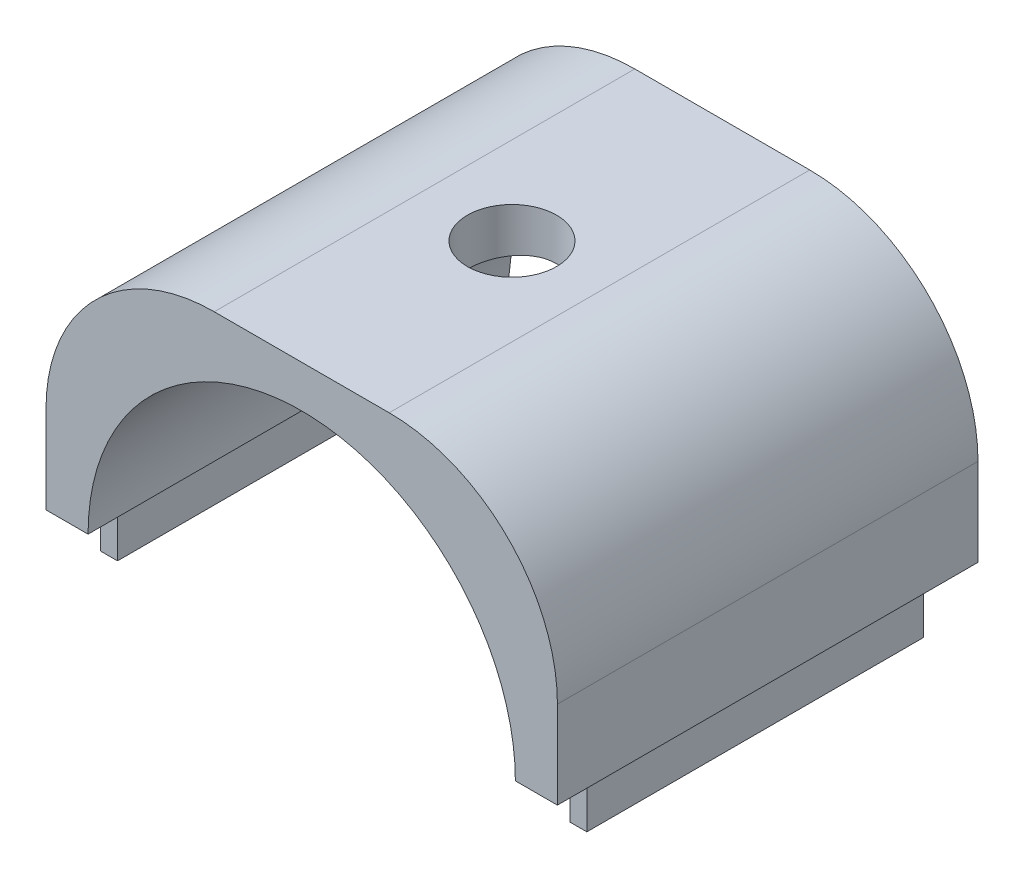
ISO-10303-21;
HEADER;
FILE_DESCRIPTION(('STEP AP214'),'2;1');
FILE_NAME('part.step','',(''),(''),'','','');
FILE_SCHEMA(('AUTOMOTIVE_DESIGN { 1 0 10303 214 1 1 1 1 }'));
ENDSEC;
DATA;
#1=APPLICATION_CONTEXT('core data for automotive mechanical design processes');
#2=APPLICATION_PROTOCOL_DEFINITION('international standard','automotive_design',2000,#1);
#3=PRODUCT_CONTEXT('',#1,'mechanical');
#4=PRODUCT('Part','Part','',(#3));
#5=PRODUCT_RELATED_PRODUCT_CATEGORY('part','',(#4));
#6=PRODUCT_DEFINITION_FORMATION('','',#4);
#7=PRODUCT_DEFINITION_CONTEXT('part definition',#1,'design');
#8=PRODUCT_DEFINITION('design','',#6,#7);
#9=PRODUCT_DEFINITION_SHAPE('','',#8);
#10=(LENGTH_UNIT() NAMED_UNIT(*) SI_UNIT(.MILLI.,.METRE.));
#11=(NAMED_UNIT(*) PLANE_ANGLE_UNIT() SI_UNIT($,.RADIAN.));
#12=(NAMED_UNIT(*) SI_UNIT($,.STERADIAN.) SOLID_ANGLE_UNIT());
#13=UNCERTAINTY_MEASURE_WITH_UNIT(LENGTH_MEASURE(1.E-05),#10,'distance_accuracy_value','');
#14=(GEOMETRIC_REPRESENTATION_CONTEXT(3) GLOBAL_UNCERTAINTY_ASSIGNED_CONTEXT((#13)) GLOBAL_UNIT_ASSIGNED_CONTEXT((#10,
#11,#12)) REPRESENTATION_CONTEXT('',''));
#15=CARTESIAN_POINT('',(0.,0.,0.));
#16=DIRECTION('',(0.,0.,1.));
#17=DIRECTION('',(1.,0.,0.));
#18=AXIS2_PLACEMENT_3D('',#15,#16,#17);
#19=CARTESIAN_POINT('',(12.7,0.,12.5));
#20=DIRECTION('',(0.,1.,0.));
#21=DIRECTION('',(-1.,0.,0.));
#22=AXIS2_PLACEMENT_3D('',#19,#20,#21);
#23=PLANE('',#22);
#24=DIRECTION('',(1.,0.,0.));
#25=VECTOR('',#24,1.);
#26=CARTESIAN_POINT('',(12.7,0.,-12.5));
#27=LINE('',#26,#25);
#28=CARTESIAN_POINT('',(12.7,0.,-12.5));
#29=VERTEX_POINT('',#28);
#30=CARTESIAN_POINT('',(15.2,0.,-12.5));
#31=VERTEX_POINT('',#30);
#32=EDGE_CURVE('E295',#29,#31,#27,.T.);
#33=ORIENTED_EDGE('',*,*,#32,.T.);
#34=DIRECTION('',(0.,0.,-1.));
#35=VECTOR('',#34,1.);
#36=CARTESIAN_POINT('',(15.2,0.,12.5));
#37=LINE('',#36,#35);
#38=CARTESIAN_POINT('',(15.2,0.,12.5));
#39=VERTEX_POINT('',#38);
#40=EDGE_CURVE('E303',#39,#31,#37,.T.);
#41=ORIENTED_EDGE('',*,*,#40,.F.);
#42=DIRECTION('',(1.,0.,0.));
#43=VECTOR('',#42,1.);
#44=CARTESIAN_POINT('',(12.7,0.,12.5));
#45=LINE('',#44,#43);
#46=CARTESIAN_POINT('',(12.7,0.,12.5));
#47=VERTEX_POINT('',#46);
#48=EDGE_CURVE('E269',#47,#39,#45,.T.);
#49=ORIENTED_EDGE('',*,*,#48,.F.);
#50=DIRECTION('',(0.,0.,-1.));
#51=VECTOR('',#50,1.);
#52=CARTESIAN_POINT('',(12.7,0.,12.5));
#53=LINE('',#52,#51);
#54=EDGE_CURVE('E307',#47,#29,#53,.T.);
#55=ORIENTED_EDGE('',*,*,#54,.T.);
#56=EDGE_LOOP('',(#33,#41,#49,#55));
#57=FACE_BOUND('',#56,.T.);
#58=DIRECTION('',(0.,0.,1.));
#59=VECTOR('',#58,1.);
#60=CARTESIAN_POINT('',(14.45,0.,-10.));
#61=LINE('',#60,#59);
#62=CARTESIAN_POINT('',(14.45,0.,-10.));
#63=VERTEX_POINT('',#62);
#64=CARTESIAN_POINT('',(14.45,0.,10.));
#65=VERTEX_POINT('',#64);
#66=EDGE_CURVE('E155',#63,#65,#61,.T.);
#67=ORIENTED_EDGE('',*,*,#66,.F.);
#68=DIRECTION('',(1.,0.,0.));
#69=VECTOR('',#68,1.);
#70=CARTESIAN_POINT('',(14.45,0.,-10.));
#71=LINE('',#70,#69);
#72=CARTESIAN_POINT('',(13.45,0.,-10.));
#73=VERTEX_POINT('',#72);
#74=EDGE_CURVE('E157',#73,#63,#71,.T.);
#75=ORIENTED_EDGE('',*,*,#74,.F.);
#76=DIRECTION('',(0.,0.,-1.));
#77=VECTOR('',#76,1.);
#78=CARTESIAN_POINT('',(13.45,0.,-10.));
#79=LINE('',#78,#77);
#80=CARTESIAN_POINT('',(13.45,0.,10.));
#81=VERTEX_POINT('',#80);
#82=EDGE_CURVE('E66',#81,#73,#79,.T.);
#83=ORIENTED_EDGE('',*,*,#82,.F.);
#84=DIRECTION('',(-1.,0.,0.));
#85=VECTOR('',#84,1.);
#86=CARTESIAN_POINT('',(14.45,0.,10.));
#87=LINE('',#86,#85);
#88=EDGE_CURVE('E61',#65,#81,#87,.T.);
#89=ORIENTED_EDGE('',*,*,#88,.F.);
#90=EDGE_LOOP('',(#67,#75,#83,#89));
#91=FACE_BOUND('',#90,.T.);
#92=ADVANCED_FACE('F39',(#57,#91),#23,.F.);
#93=CARTESIAN_POINT('',(-15.2,0.,12.5));
#94=DIRECTION('',(0.,1.,0.));
#95=DIRECTION('',(-1.,0.,0.));
#96=AXIS2_PLACEMENT_3D('',#93,#94,#95);
#97=PLANE('',#96);
#98=DIRECTION('',(1.,0.,0.));
#99=VECTOR('',#98,1.);
#100=CARTESIAN_POINT('',(-15.2,0.,-12.5));
#101=LINE('',#100,#99);
#102=CARTESIAN_POINT('',(-15.2,0.,-12.5));
#103=VERTEX_POINT('',#102);
#104=CARTESIAN_POINT('',(-12.7,0.,-12.5));
#105=VERTEX_POINT('',#104);
#106=EDGE_CURVE('E289',#103,#105,#101,.T.);
#107=ORIENTED_EDGE('',*,*,#106,.T.);
#108=DIRECTION('',(0.,0.,-1.));
#109=VECTOR('',#108,1.);
#110=CARTESIAN_POINT('',(-12.7,0.,12.5));
#111=LINE('',#110,#109);
#112=CARTESIAN_POINT('',(-12.7,0.,12.5));
#113=VERTEX_POINT('',#112);
#114=EDGE_CURVE('E311',#113,#105,#111,.T.);
#115=ORIENTED_EDGE('',*,*,#114,.F.);
#116=DIRECTION('',(1.,0.,0.));
#117=VECTOR('',#116,1.);
#118=CARTESIAN_POINT('',(-15.2,0.,12.5));
#119=LINE('',#118,#117);
#120=CARTESIAN_POINT('',(-15.2,0.,12.5));
#121=VERTEX_POINT('',#120);
#122=EDGE_CURVE('E263',#121,#113,#119,.T.);
#123=ORIENTED_EDGE('',*,*,#122,.F.);
#124=DIRECTION('',(0.,0.,-1.));
#125=VECTOR('',#124,1.);
#126=CARTESIAN_POINT('',(-15.2,0.,12.5));
#127=LINE('',#126,#125);
#128=EDGE_CURVE('E315',#121,#103,#127,.T.);
#129=ORIENTED_EDGE('',*,*,#128,.T.);
#130=EDGE_LOOP('',(#107,#115,#123,#129));
#131=FACE_BOUND('',#130,.T.);
#132=DIRECTION('',(0.,0.,1.));
#133=VECTOR('',#132,1.);
#134=CARTESIAN_POINT('',(-13.45,0.,-10.));
#135=LINE('',#134,#133);
#136=CARTESIAN_POINT('',(-13.45,0.,-10.));
#137=VERTEX_POINT('',#136);
#138=CARTESIAN_POINT('',(-13.45,0.,10.));
#139=VERTEX_POINT('',#138);
#140=EDGE_CURVE('E162',#137,#139,#135,.T.);
#141=ORIENTED_EDGE('',*,*,#140,.F.);
#142=DIRECTION('',(1.,0.,0.));
#143=VECTOR('',#142,1.);
#144=CARTESIAN_POINT('',(-14.45,0.,-10.));
#145=LINE('',#144,#143);
#146=CARTESIAN_POINT('',(-14.45,0.,-10.));
#147=VERTEX_POINT('',#146);
#148=EDGE_CURVE('E206',#147,#137,#145,.T.);
#149=ORIENTED_EDGE('',*,*,#148,.F.);
#150=DIRECTION('',(0.,0.,-1.));
#151=VECTOR('',#150,1.);
#152=CARTESIAN_POINT('',(-14.45,0.,-10.));
#153=LINE('',#152,#151);
#154=CARTESIAN_POINT('',(-14.45,0.,10.));
#155=VERTEX_POINT('',#154);
#156=EDGE_CURVE('E223',#155,#147,#153,.T.);
#157=ORIENTED_EDGE('',*,*,#156,.F.);
#158=DIRECTION('',(-1.,0.,0.));
#159=VECTOR('',#158,1.);
#160=CARTESIAN_POINT('',(-14.45,0.,10.));
#161=LINE('',#160,#159);
#162=EDGE_CURVE('E219',#139,#155,#161,.T.);
#163=ORIENTED_EDGE('',*,*,#162,.F.);
#164=EDGE_LOOP('',(#141,#149,#157,#163));
#165=FACE_BOUND('',#164,.T.);
#166=ADVANCED_FACE('F345',(#131,#165),#97,.F.);
#167=CARTESIAN_POINT('',(5.2,5.2,12.5));
#168=DIRECTION('',(0.,0.,-1.));
#169=DIRECTION('',(-1.,0.,0.));
#170=AXIS2_PLACEMENT_3D('',#167,#168,#169);
#171=CYLINDRICAL_SURFACE('',#170,10.);
#172=CARTESIAN_POINT('',(5.2,5.2,-12.5));
#173=DIRECTION('',(0.,0.,1.));
#174=DIRECTION('',(1.,0.,0.));
#175=AXIS2_PLACEMENT_3D('',#172,#173,#174);
#176=CIRCLE('',#175,10.);
#177=CARTESIAN_POINT('',(15.2,5.2,-12.5));
#178=VERTEX_POINT('',#177);
#179=CARTESIAN_POINT('',(5.2,15.2,-12.5));
#180=VERTEX_POINT('',#179);
#181=EDGE_CURVE('E276',#178,#180,#176,.T.);
#182=ORIENTED_EDGE('',*,*,#181,.T.);
#183=DIRECTION('',(0.,0.,-1.));
#184=VECTOR('',#183,1.);
#185=CARTESIAN_POINT('',(5.2,15.2,12.5));
#186=LINE('',#185,#184);
#187=CARTESIAN_POINT('',(5.2,15.2,12.5));
#188=VERTEX_POINT('',#187);
#189=EDGE_CURVE('E11',#188,#180,#186,.T.);
#190=ORIENTED_EDGE('',*,*,#189,.F.);
#191=CARTESIAN_POINT('',(5.2,5.2,12.5));
#192=DIRECTION('',(0.,0.,1.));
#193=DIRECTION('',(1.,0.,0.));
#194=AXIS2_PLACEMENT_3D('',#191,#192,#193);
#195=CIRCLE('',#194,10.);
#196=CARTESIAN_POINT('',(15.2,5.2,12.5));
#197=VERTEX_POINT('',#196);
#198=EDGE_CURVE('E249',#197,#188,#195,.T.);
#199=ORIENTED_EDGE('',*,*,#198,.F.);
#200=DIRECTION('',(0.,0.,-1.));
#201=VECTOR('',#200,1.);
#202=CARTESIAN_POINT('',(15.2,5.2,12.5));
#203=LINE('',#202,#201);
#204=EDGE_CURVE('E275',#197,#178,#203,.T.);
#205=ORIENTED_EDGE('',*,*,#204,.T.);
#206=EDGE_LOOP('',(#182,#190,#199,#205));
#207=FACE_BOUND('',#206,.T.);
#208=ADVANCED_FACE('F41',(#207),#171,.T.);
#209=CARTESIAN_POINT('',(5.2,15.2,12.5));
#210=DIRECTION('',(0.,-1.,0.));
#211=DIRECTION('',(0.,0.,-1.));
#212=AXIS2_PLACEMENT_3D('',#209,#210,#211);
#213=PLANE('',#212);
#214=CARTESIAN_POINT('',(0.,15.2,0.));
#215=DIRECTION('',(0.,1.,0.));
#216=DIRECTION('',(0.,0.,1.));
#217=AXIS2_PLACEMENT_3D('',#214,#215,#216);
#218=CIRCLE('',#217,2.65);
#219=CARTESIAN_POINT('',(0.,15.2,2.65));
#220=VERTEX_POINT('',#219);
#221=EDGE_CURVE('E245',#220,#220,#218,.T.);
#222=ORIENTED_EDGE('',*,*,#221,.F.);
#223=EDGE_LOOP('',(#222));
#224=FACE_BOUND('',#223,.T.);
#225=DIRECTION('',(-1.,0.,0.));
#226=VECTOR('',#225,1.);
#227=CARTESIAN_POINT('',(5.2,15.2,-12.5));
#228=LINE('',#227,#226);
#229=CARTESIAN_POINT('',(-5.2,15.2,-12.5));
#230=VERTEX_POINT('',#229);
#231=EDGE_CURVE('E280',#180,#230,#228,.T.);
#232=ORIENTED_EDGE('',*,*,#231,.T.);
#233=DIRECTION('',(0.,0.,-1.));
#234=VECTOR('',#233,1.);
#235=CARTESIAN_POINT('',(-5.2,15.2,12.5));
#236=LINE('',#235,#234);
#237=CARTESIAN_POINT('',(-5.2,15.2,12.5));
#238=VERTEX_POINT('',#237);
#239=EDGE_CURVE('E54',#238,#230,#236,.T.);
#240=ORIENTED_EDGE('',*,*,#239,.F.);
#241=DIRECTION('',(-1.,0.,0.));
#242=VECTOR('',#241,1.);
#243=CARTESIAN_POINT('',(5.2,15.2,12.5));
#244=LINE('',#243,#242);
#245=EDGE_CURVE('E253',#188,#238,#244,.T.);
#246=ORIENTED_EDGE('',*,*,#245,.F.);
#247=ORIENTED_EDGE('',*,*,#189,.T.);
#248=EDGE_LOOP('',(#232,#240,#246,#247));
#249=FACE_BOUND('',#248,.T.);
#250=ADVANCED_FACE('F354',(#224,#249),#213,.F.);
#251=CARTESIAN_POINT('',(-5.2,5.2,12.5));
#252=DIRECTION('',(0.,0.,-1.));
#253=DIRECTION('',(-1.,0.,0.));
#254=AXIS2_PLACEMENT_3D('',#251,#252,#253);
#255=CYLINDRICAL_SURFACE('',#254,10.);
#256=CARTESIAN_POINT('',(-5.2,5.2,-12.5));
#257=DIRECTION('',(0.,0.,1.));
#258=DIRECTION('',(1.,0.,0.));
#259=AXIS2_PLACEMENT_3D('',#256,#257,#258);
#260=CIRCLE('',#259,10.);
#261=CARTESIAN_POINT('',(-15.2,5.2,-12.5));
#262=VERTEX_POINT('',#261);
#263=EDGE_CURVE('E283',#230,#262,#260,.T.);
#264=ORIENTED_EDGE('',*,*,#263,.T.);
#265=DIRECTION('',(0.,0.,-1.));
#266=VECTOR('',#265,1.);
#267=CARTESIAN_POINT('',(-15.2,5.2,12.5));
#268=LINE('',#267,#266);
#269=CARTESIAN_POINT('',(-15.2,5.2,12.5));
#270=VERTEX_POINT('',#269);
#271=EDGE_CURVE('E319',#270,#262,#268,.T.);
#272=ORIENTED_EDGE('',*,*,#271,.F.);
#273=CARTESIAN_POINT('',(-5.2,5.2,12.5));
#274=DIRECTION('',(0.,0.,1.));
#275=DIRECTION('',(1.,0.,0.));
#276=AXIS2_PLACEMENT_3D('',#273,#274,#275);
#277=CIRCLE('',#276,10.);
#278=EDGE_CURVE('E257',#238,#270,#277,.T.);
#279=ORIENTED_EDGE('',*,*,#278,.F.);
#280=ORIENTED_EDGE('',*,*,#239,.T.);
#281=EDGE_LOOP('',(#264,#272,#279,#280));
#282=FACE_BOUND('',#281,.T.);
#283=ADVANCED_FACE('F330',(#282),#255,.T.);
#284=CARTESIAN_POINT('',(-15.2,0.,12.5));
#285=DIRECTION('',(1.,0.,0.));
#286=DIRECTION('',(0.,0.,-1.));
#287=AXIS2_PLACEMENT_3D('',#284,#285,#286);
#288=PLANE('',#287);
#289=DIRECTION('',(0.,-1.,0.));
#290=VECTOR('',#289,1.);
#291=CARTESIAN_POINT('',(-15.2,0.,-12.5));
#292=LINE('',#291,#290);
#293=EDGE_CURVE('E286',#262,#103,#292,.T.);
#294=ORIENTED_EDGE('',*,*,#293,.T.);
#295=ORIENTED_EDGE('',*,*,#128,.F.);
#296=DIRECTION('',(0.,-1.,0.));
#297=VECTOR('',#296,1.);
#298=CARTESIAN_POINT('',(-15.2,0.,12.5));
#299=LINE('',#298,#297);
#300=EDGE_CURVE('E260',#270,#121,#299,.T.);
#301=ORIENTED_EDGE('',*,*,#300,.F.);
#302=ORIENTED_EDGE('',*,*,#271,.T.);
#303=EDGE_LOOP('',(#294,#295,#301,#302));
#304=FACE_BOUND('',#303,.T.);
#305=ADVANCED_FACE('F341',(#304),#288,.F.);
#306=CARTESIAN_POINT('',(0.,0.,12.5));
#307=DIRECTION('',(0.,0.,-1.));
#308=DIRECTION('',(-1.,0.,0.));
#309=AXIS2_PLACEMENT_3D('',#306,#307,#308);
#310=CYLINDRICAL_SURFACE('',#309,12.7);
#311=CARTESIAN_POINT('',(0.,12.7,2.65));
#312=CARTESIAN_POINT('',(0.147141882897111,12.6999972763347,2.64999475465868));
#313=CARTESIAN_POINT('',(0.294348726054904,12.6974166980673,2.63770347265537));
#314=CARTESIAN_POINT('',(0.584592235158729,12.6873713227314,2.58890755430151));
#315=CARTESIAN_POINT('',(0.727625652744173,12.6799028218124,2.55238455594515));
#316=CARTESIAN_POINT('',(1.00528473690564,12.6609144811852,2.45631004538645));
#317=CARTESIAN_POINT('',(1.13991863313509,12.6493986827301,2.39678149849168));
#318=CARTESIAN_POINT('',(1.39728064695569,12.6235635459398,2.25645606395814));
#319=CARTESIAN_POINT('',(1.52000929057391,12.6092443315563,2.17566011659413));
#320=CARTESIAN_POINT('',(1.75188561540099,12.5791400264574,1.99383714269698));
#321=CARTESIAN_POINT('',(1.86083344538849,12.5633381330538,1.89255800687734));
#322=CARTESIAN_POINT('',(2.06032392646105,12.5321699287456,1.67318523480255));
#323=CARTESIAN_POINT('',(2.15086505077388,12.516803654065,1.55509020510783));
#324=CARTESIAN_POINT('',(2.31183670942836,12.4880817512634,1.30398221472771));
#325=CARTESIAN_POINT('',(2.38205767324146,12.4747477039077,1.17083222199957));
#326=CARTESIAN_POINT('',(2.49905234910732,12.4518398078046,0.894298512625698));
#327=CARTESIAN_POINT('',(2.54582859579428,12.4422655526061,0.750915904154835));
#328=CARTESIAN_POINT('',(2.61395192718573,12.4281318076225,0.460145423463227));
#329=CARTESIAN_POINT('',(2.63565112007276,12.4235029509428,0.312843487202827));
#330=CARTESIAN_POINT('',(2.6540985924028,12.4195755229538,0.0166227181360824));
#331=CARTESIAN_POINT('',(2.65084965464925,12.4202763571517,-0.132295932485803));
#332=CARTESIAN_POINT('',(2.61977717314308,12.4268662012071,-0.424928131939138));
#333=CARTESIAN_POINT('',(2.59235969216865,12.4326694792853,-0.56868701825834));
#334=CARTESIAN_POINT('',(2.51437043169713,12.4486750880903,-0.849518694026506));
#335=CARTESIAN_POINT('',(2.46379745860189,12.4588776455855,-0.986591138405782));
#336=CARTESIAN_POINT('',(2.34055182042824,12.4826184585991,-1.25131618063678));
#337=CARTESIAN_POINT('',(2.26772038872651,12.4961805409951,-1.37889263741752));
#338=CARTESIAN_POINT('',(2.10213709349326,12.5250973158712,-1.62016481226238));
#339=CARTESIAN_POINT('',(2.00938274713902,12.5404522316679,-1.73385879750025));
#340=CARTESIAN_POINT('',(1.80442358397749,12.5715943668517,-1.94647941827634));
#341=CARTESIAN_POINT('',(1.69187276734042,12.5873841563106,-2.04507244689971));
#342=CARTESIAN_POINT('',(1.45165961406066,12.6173416738254,-2.22203478951815));
#343=CARTESIAN_POINT('',(1.32399704933812,12.631509377393,-2.30040379821769));
#344=CARTESIAN_POINT('',(1.05679717182286,12.6566660975857,-2.43476451292158));
#345=CARTESIAN_POINT('',(0.917238837604389,12.6676493295507,-2.49071556575015));
#346=CARTESIAN_POINT('',(0.630422255980448,12.6851561394605,-2.57828286996085));
#347=CARTESIAN_POINT('',(0.483165028279239,12.6916803063975,-2.60990233534086));
#348=CARTESIAN_POINT('',(0.187995182270744,12.6994510445978,-2.64743076462122));
#349=CARTESIAN_POINT('',(0.0401429528166278,12.7007912412963,-2.65379589111137));
#350=CARTESIAN_POINT('',(-0.254512218231061,12.69830413272,-2.64186703418381));
#351=CARTESIAN_POINT('',(-0.401315223729108,12.6944771449031,-2.62357456566271));
#352=CARTESIAN_POINT('',(-0.688215139982566,12.6821444836504,-2.56322845841393));
#353=CARTESIAN_POINT('',(-0.828363955680935,12.6736853827337,-2.52141123138305));
#354=CARTESIAN_POINT('',(-1.09965953956823,12.6530342115635,-2.4154628203329));
#355=CARTESIAN_POINT('',(-1.23080558908868,12.6408418437157,-2.35132985737808));
#356=CARTESIAN_POINT('',(-1.48227976768071,12.6138442773516,-2.20160013701121));
#357=CARTESIAN_POINT('',(-1.60244262191945,12.5990067736679,-2.11573174807266));
#358=CARTESIAN_POINT('',(-1.82681720599617,12.5684360253891,-1.92532962658825));
#359=CARTESIAN_POINT('',(-1.93102706032944,12.5527026757724,-1.82079370253006));
#360=CARTESIAN_POINT('',(-2.12231758796238,12.5217943375682,-1.59393952979798));
#361=CARTESIAN_POINT('',(-2.20908383725437,12.5066330248723,-1.47135395341373));
#362=CARTESIAN_POINT('',(-2.36079659493772,12.4788866385666,-1.21308133836605));
#363=CARTESIAN_POINT('',(-2.42574401307147,12.4663014575528,-1.07739484625283));
#364=CARTESIAN_POINT('',(-2.53155850799125,12.4452450938604,-0.797479129438785));
#365=CARTESIAN_POINT('',(-2.57255575495104,12.4367517171345,-0.653300862441296));
#366=CARTESIAN_POINT('',(-2.62969528570611,12.4247965890246,-0.359904009243205));
#367=CARTESIAN_POINT('',(-2.64584113772638,12.421334115295,-0.210686149784604));
#368=CARTESIAN_POINT('',(-2.65267845237252,12.4198754027452,0.0853914221250781));
#369=CARTESIAN_POINT('',(-2.64386748437957,12.4217723108855,0.232239340496511));
#370=CARTESIAN_POINT('',(-2.60214584032668,12.4305785689402,0.522309661906972));
#371=CARTESIAN_POINT('',(-2.5692353971491,12.4374878704179,0.665532099966552));
#372=CARTESIAN_POINT('',(-2.4804794357266,12.4554906623169,0.943933730370845));
#373=CARTESIAN_POINT('',(-2.42470009862847,12.4665720714225,1.07913485410109));
#374=CARTESIAN_POINT('',(-2.29184902946698,12.4916763515531,1.33833579168494));
#375=CARTESIAN_POINT('',(-2.2147753131608,12.5056994966643,1.46233456025642));
#376=CARTESIAN_POINT('',(-2.03984608298033,12.535430641616,1.6980774321895));
#377=CARTESIAN_POINT('',(-1.94163334740716,12.5511649557007,1.80955319594281));
#378=CARTESIAN_POINT('',(-1.72794550486875,12.5823622745988,2.01460567207086));
#379=CARTESIAN_POINT('',(-1.6124664286996,12.5978252161132,2.10817825754015));
#380=CARTESIAN_POINT('',(-1.36591513995684,12.6269492110412,2.27579781796373));
#381=CARTESIAN_POINT('',(-1.2346778969598,12.640587333888,2.34960622720327));
#382=CARTESIAN_POINT('',(-0.96140967034859,12.6642975607395,2.47400232368923));
#383=CARTESIAN_POINT('',(-0.819388238964411,12.6743727768916,2.52461028769961));
#384=CARTESIAN_POINT('',(-0.564271087485326,12.6879363706482,2.59171884962817));
#385=CARTESIAN_POINT('',(-0.45259637894257,12.6924330652456,2.61353409688428));
#386=CARTESIAN_POINT('',(-0.227293986753254,12.6984658769144,2.64267642883828));
#387=CARTESIAN_POINT('',(-0.113666375848895,12.700002104018,2.65000405200018));
#388=CARTESIAN_POINT('',(0.,12.7,2.65));
#389=B_SPLINE_CURVE_WITH_KNOTS('',3,(#311,#312,#313,#314,#315,#316,#317,#318,#319,#320,#321,
#322,#323,#324,#325,#326,#327,#328,#329,#330,#331,#332,#333,#334,#335,#336,#337,#338,#339,#340,
#341,#342,#343,#344,#345,#346,#347,#348,#349,#350,#351,#352,#353,#354,#355,#356,#357,#358,#359,
#360,#361,#362,#363,#364,#365,#366,#367,#368,#369,#370,#371,#372,#373,#374,#375,#376,#377,#378,
#379,#380,#381,#382,#383,#384,#385,#386,#387,#388),.UNSPECIFIED.,.T.,.F.,(4,2,2,2,2,2,2,2,2,2,2,
2,2,2,2,2,2,2,2,2,2,2,2,2,2,2,2,2,2,2,2,2,2,2,2,2,2,2,4),(0.,0.441009716560806,
0.882353998194363,1.32325884083949,1.76414419346331,2.21082821198089,2.6575492662813,
3.10872551711874,3.55985298026752,4.00456608388388,4.44922958333559,4.88656158924155,
5.32391614087658,5.76446612237943,6.20507103775138,6.65432304235844,7.10358182833794,
7.55365166156387,8.00366203414392,8.44550594318443,8.88732270775553,9.32477678197637,
9.76226573655943,10.2055181274491,10.6488225890832,11.0995152534722,11.550189123769,
11.9983902097276,12.4465269358564,12.8857923193398,13.3250534580914,13.7630522761117,
14.2010919213046,14.6472142189438,15.0934392297548,15.5448297035978,15.9958249147861,
16.3365153995618,16.6771932215975),.UNSPECIFIED.);
#390=CARTESIAN_POINT('',(0.,12.7,2.65));
#391=VERTEX_POINT('',#390);
#392=EDGE_CURVE('E43',#391,#391,#389,.T.);
#393=ORIENTED_EDGE('',*,*,#392,.T.);
#394=EDGE_LOOP('',(#393));
#395=FACE_BOUND('',#394,.T.);
#396=CARTESIAN_POINT('',(0.,0.,-12.5));
#397=DIRECTION('',(0.,0.,-1.));
#398=DIRECTION('',(1.,0.,0.));
#399=AXIS2_PLACEMENT_3D('',#396,#397,#398);
#400=CIRCLE('',#399,12.7);
#401=EDGE_CURVE('E292',#105,#29,#400,.T.);
#402=ORIENTED_EDGE('',*,*,#401,.T.);
#403=ORIENTED_EDGE('',*,*,#54,.F.);
#404=CARTESIAN_POINT('',(0.,0.,12.5));
#405=DIRECTION('',(0.,0.,-1.));
#406=DIRECTION('',(1.,0.,0.));
#407=AXIS2_PLACEMENT_3D('',#404,#405,#406);
#408=CIRCLE('',#407,12.7);
#409=EDGE_CURVE('E266',#113,#47,#408,.T.);
#410=ORIENTED_EDGE('',*,*,#409,.F.);
#411=ORIENTED_EDGE('',*,*,#114,.T.);
#412=EDGE_LOOP('',(#402,#403,#410,#411));
#413=FACE_BOUND('',#412,.T.);
#414=ADVANCED_FACE('F366',(#395,#413),#310,.F.);
#415=CARTESIAN_POINT('',(15.2,0.,12.5));
#416=DIRECTION('',(-1.,0.,0.));
#417=DIRECTION('',(0.,0.,1.));
#418=AXIS2_PLACEMENT_3D('',#415,#416,#417);
#419=PLANE('',#418);
#420=DIRECTION('',(0.,1.,0.));
#421=VECTOR('',#420,1.);
#422=CARTESIAN_POINT('',(15.2,0.,-12.5));
#423=LINE('',#422,#421);
#424=EDGE_CURVE('E254',#31,#178,#423,.T.);
#425=ORIENTED_EDGE('',*,*,#424,.T.);
#426=ORIENTED_EDGE('',*,*,#204,.F.);
#427=DIRECTION('',(0.,1.,0.));
#428=VECTOR('',#427,1.);
#429=CARTESIAN_POINT('',(15.2,0.,12.5));
#430=LINE('',#429,#428);
#431=EDGE_CURVE('E272',#39,#197,#430,.T.);
#432=ORIENTED_EDGE('',*,*,#431,.F.);
#433=ORIENTED_EDGE('',*,*,#40,.T.);
#434=EDGE_LOOP('',(#425,#426,#432,#433));
#435=FACE_BOUND('',#434,.T.);
#436=ADVANCED_FACE('F360',(#435),#419,.F.);
#437=CARTESIAN_POINT('',(5.2,5.2,12.5));
#438=DIRECTION('',(0.,0.,1.));
#439=DIRECTION('',(1.,0.,0.));
#440=AXIS2_PLACEMENT_3D('',#437,#438,#439);
#441=PLANE('',#440);
#442=ORIENTED_EDGE('',*,*,#198,.T.);
#443=ORIENTED_EDGE('',*,*,#245,.T.);
#444=ORIENTED_EDGE('',*,*,#278,.T.);
#445=ORIENTED_EDGE('',*,*,#300,.T.);
#446=ORIENTED_EDGE('',*,*,#122,.T.);
#447=ORIENTED_EDGE('',*,*,#409,.T.);
#448=ORIENTED_EDGE('',*,*,#48,.T.);
#449=ORIENTED_EDGE('',*,*,#431,.T.);
#450=EDGE_LOOP('',(#442,#443,#444,#445,#446,#447,#448,#449));
#451=FACE_BOUND('',#450,.T.);
#452=ADVANCED_FACE('F350',(#451),#441,.T.);
#453=CARTESIAN_POINT('',(5.2,5.2,-12.5));
#454=DIRECTION('',(0.,0.,1.));
#455=DIRECTION('',(1.,0.,0.));
#456=AXIS2_PLACEMENT_3D('',#453,#454,#455);
#457=PLANE('',#456);
#458=ORIENTED_EDGE('',*,*,#181,.F.);
#459=ORIENTED_EDGE('',*,*,#424,.F.);
#460=ORIENTED_EDGE('',*,*,#32,.F.);
#461=ORIENTED_EDGE('',*,*,#401,.F.);
#462=ORIENTED_EDGE('',*,*,#106,.F.);
#463=ORIENTED_EDGE('',*,*,#293,.F.);
#464=ORIENTED_EDGE('',*,*,#263,.F.);
#465=ORIENTED_EDGE('',*,*,#231,.F.);
#466=EDGE_LOOP('',(#458,#459,#460,#461,#462,#463,#464,#465));
#467=FACE_BOUND('',#466,.T.);
#468=ADVANCED_FACE('F336',(#467),#457,.F.);
#469=CARTESIAN_POINT('',(0.,15.2,0.));
#470=DIRECTION('',(0.,1.,0.));
#471=DIRECTION('',(0.,0.,1.));
#472=AXIS2_PLACEMENT_3D('',#469,#470,#471);
#473=CYLINDRICAL_SURFACE('',#472,2.65);
#474=ORIENTED_EDGE('',*,*,#221,.T.);
#475=EDGE_LOOP('',(#474));
#476=FACE_BOUND('',#475,.T.);
#477=ORIENTED_EDGE('',*,*,#392,.F.);
#478=EDGE_LOOP('',(#477));
#479=FACE_BOUND('',#478,.T.);
#480=ADVANCED_FACE('F386',(#476,#479),#473,.F.);
#481=CARTESIAN_POINT('',(-13.45,-3.,-10.));
#482=DIRECTION('',(-1.,0.,0.));
#483=DIRECTION('',(0.,-1.,0.));
#484=AXIS2_PLACEMENT_3D('',#481,#482,#483);
#485=PLANE('',#484);
#486=ORIENTED_EDGE('',*,*,#140,.T.);
#487=DIRECTION('',(0.,1.,0.));
#488=VECTOR('',#487,1.);
#489=CARTESIAN_POINT('',(-13.45,-3.,10.));
#490=LINE('',#489,#488);
#491=CARTESIAN_POINT('',(-13.45,-3.,10.));
#492=VERTEX_POINT('',#491);
#493=EDGE_CURVE('E241',#492,#139,#490,.T.);
#494=ORIENTED_EDGE('',*,*,#493,.F.);
#495=DIRECTION('',(0.,0.,1.));
#496=VECTOR('',#495,1.);
#497=CARTESIAN_POINT('',(-13.45,-3.,-10.));
#498=LINE('',#497,#496);
#499=CARTESIAN_POINT('',(-13.45,-3.,-10.));
#500=VERTEX_POINT('',#499);
#501=EDGE_CURVE('E201',#500,#492,#498,.T.);
#502=ORIENTED_EDGE('',*,*,#501,.F.);
#503=DIRECTION('',(0.,1.,0.));
#504=VECTOR('',#503,1.);
#505=CARTESIAN_POINT('',(-13.45,-3.,-10.));
#506=LINE('',#505,#504);
#507=EDGE_CURVE('E215',#500,#137,#506,.T.);
#508=ORIENTED_EDGE('',*,*,#507,.T.);
#509=EDGE_LOOP('',(#486,#494,#502,#508));
#510=FACE_BOUND('',#509,.T.);
#511=ADVANCED_FACE('F391',(#510),#485,.F.);
#512=CARTESIAN_POINT('',(-14.45,-3.,10.));
#513=DIRECTION('',(0.,0.,-1.));
#514=DIRECTION('',(-1.,0.,0.));
#515=AXIS2_PLACEMENT_3D('',#512,#513,#514);
#516=PLANE('',#515);
#517=ORIENTED_EDGE('',*,*,#162,.T.);
#518=DIRECTION('',(0.,1.,0.));
#519=VECTOR('',#518,1.);
#520=CARTESIAN_POINT('',(-14.45,-3.,10.));
#521=LINE('',#520,#519);
#522=CARTESIAN_POINT('',(-14.45,-3.,10.));
#523=VERTEX_POINT('',#522);
#524=EDGE_CURVE('E237',#523,#155,#521,.T.);
#525=ORIENTED_EDGE('',*,*,#524,.F.);
#526=DIRECTION('',(-1.,0.,0.));
#527=VECTOR('',#526,1.);
#528=CARTESIAN_POINT('',(-14.45,-3.,10.));
#529=LINE('',#528,#527);
#530=EDGE_CURVE('E205',#492,#523,#529,.T.);
#531=ORIENTED_EDGE('',*,*,#530,.F.);
#532=ORIENTED_EDGE('',*,*,#493,.T.);
#533=EDGE_LOOP('',(#517,#525,#531,#532));
#534=FACE_BOUND('',#533,.T.);
#535=ADVANCED_FACE('F395',(#534),#516,.F.);
#536=CARTESIAN_POINT('',(-14.45,-3.,-10.));
#537=DIRECTION('',(1.,0.,0.));
#538=DIRECTION('',(0.,1.,0.));
#539=AXIS2_PLACEMENT_3D('',#536,#537,#538);
#540=PLANE('',#539);
#541=ORIENTED_EDGE('',*,*,#156,.T.);
#542=DIRECTION('',(0.,1.,0.));
#543=VECTOR('',#542,1.);
#544=CARTESIAN_POINT('',(-14.45,-3.,-10.));
#545=LINE('',#544,#543);
#546=CARTESIAN_POINT('',(-14.45,-3.,-10.));
#547=VERTEX_POINT('',#546);
#548=EDGE_CURVE('E233',#547,#147,#545,.T.);
#549=ORIENTED_EDGE('',*,*,#548,.F.);
#550=DIRECTION('',(0.,0.,-1.));
#551=VECTOR('',#550,1.);
#552=CARTESIAN_POINT('',(-14.45,-3.,-10.));
#553=LINE('',#552,#551);
#554=EDGE_CURVE('E209',#523,#547,#553,.T.);
#555=ORIENTED_EDGE('',*,*,#554,.F.);
#556=ORIENTED_EDGE('',*,*,#524,.T.);
#557=EDGE_LOOP('',(#541,#549,#555,#556));
#558=FACE_BOUND('',#557,.T.);
#559=ADVANCED_FACE('F399',(#558),#540,.F.);
#560=CARTESIAN_POINT('',(-14.45,-3.,-10.));
#561=DIRECTION('',(0.,0.,1.));
#562=DIRECTION('',(1.,0.,0.));
#563=AXIS2_PLACEMENT_3D('',#560,#561,#562);
#564=PLANE('',#563);
#565=ORIENTED_EDGE('',*,*,#148,.T.);
#566=ORIENTED_EDGE('',*,*,#507,.F.);
#567=DIRECTION('',(1.,0.,0.));
#568=VECTOR('',#567,1.);
#569=CARTESIAN_POINT('',(-14.45,-3.,-10.));
#570=LINE('',#569,#568);
#571=EDGE_CURVE('E212',#547,#500,#570,.T.);
#572=ORIENTED_EDGE('',*,*,#571,.F.);
#573=ORIENTED_EDGE('',*,*,#548,.T.);
#574=EDGE_LOOP('',(#565,#566,#572,#573));
#575=FACE_BOUND('',#574,.T.);
#576=ADVANCED_FACE('F403',(#575),#564,.F.);
#577=CARTESIAN_POINT('',(0.,-3.,0.));
#578=DIRECTION('',(0.,1.,0.));
#579=DIRECTION('',(-1.,0.,0.));
#580=AXIS2_PLACEMENT_3D('',#577,#578,#579);
#581=PLANE('',#580);
#582=ORIENTED_EDGE('',*,*,#501,.T.);
#583=ORIENTED_EDGE('',*,*,#530,.T.);
#584=ORIENTED_EDGE('',*,*,#554,.T.);
#585=ORIENTED_EDGE('',*,*,#571,.T.);
#586=EDGE_LOOP('',(#582,#583,#584,#585));
#587=FACE_BOUND('',#586,.T.);
#588=ADVANCED_FACE('F407',(#587),#581,.F.);
#589=CARTESIAN_POINT('',(14.45,-3.,-10.));
#590=DIRECTION('',(-1.,0.,0.));
#591=DIRECTION('',(0.,0.,1.));
#592=AXIS2_PLACEMENT_3D('',#589,#590,#591);
#593=PLANE('',#592);
#594=ORIENTED_EDGE('',*,*,#66,.T.);
#595=DIRECTION('',(0.,1.,0.));
#596=VECTOR('',#595,1.);
#597=CARTESIAN_POINT('',(14.45,-3.,10.));
#598=LINE('',#597,#596);
#599=CARTESIAN_POINT('',(14.45,-3.,10.));
#600=VERTEX_POINT('',#599);
#601=EDGE_CURVE('E653',#600,#65,#598,.T.);
#602=ORIENTED_EDGE('',*,*,#601,.F.);
#603=DIRECTION('',(0.,0.,1.));
#604=VECTOR('',#603,1.);
#605=CARTESIAN_POINT('',(14.45,-3.,-10.));
#606=LINE('',#605,#604);
#607=CARTESIAN_POINT('',(14.45,-3.,-10.));
#608=VERTEX_POINT('',#607);
#609=EDGE_CURVE('E174',#608,#600,#606,.T.);
#610=ORIENTED_EDGE('',*,*,#609,.F.);
#611=DIRECTION('',(0.,1.,0.));
#612=VECTOR('',#611,1.);
#613=CARTESIAN_POINT('',(14.45,-3.,-10.));
#614=LINE('',#613,#612);
#615=EDGE_CURVE('E169',#608,#63,#614,.T.);
#616=ORIENTED_EDGE('',*,*,#615,.T.);
#617=EDGE_LOOP('',(#594,#602,#610,#616));
#618=FACE_BOUND('',#617,.T.);
#619=ADVANCED_FACE('F176',(#618),#593,.F.);
#620=CARTESIAN_POINT('',(14.45,-3.,10.));
#621=DIRECTION('',(0.,0.,-1.));
#622=DIRECTION('',(-1.,0.,0.));
#623=AXIS2_PLACEMENT_3D('',#620,#621,#622);
#624=PLANE('',#623);
#625=ORIENTED_EDGE('',*,*,#88,.T.);
#626=DIRECTION('',(0.,1.,0.));
#627=VECTOR('',#626,1.);
#628=CARTESIAN_POINT('',(13.45,-3.,10.));
#629=LINE('',#628,#627);
#630=CARTESIAN_POINT('',(13.45,-3.,10.));
#631=VERTEX_POINT('',#630);
#632=EDGE_CURVE('E186',#631,#81,#629,.T.);
#633=ORIENTED_EDGE('',*,*,#632,.F.);
#634=DIRECTION('',(-1.,0.,0.));
#635=VECTOR('',#634,1.);
#636=CARTESIAN_POINT('',(14.45,-3.,10.));
#637=LINE('',#636,#635);
#638=EDGE_CURVE('E196',#600,#631,#637,.T.);
#639=ORIENTED_EDGE('',*,*,#638,.F.);
#640=ORIENTED_EDGE('',*,*,#601,.T.);
#641=EDGE_LOOP('',(#625,#633,#639,#640));
#642=FACE_BOUND('',#641,.T.);
#643=ADVANCED_FACE('F421',(#642),#624,.F.);
#644=CARTESIAN_POINT('',(13.45,-3.,-10.));
#645=DIRECTION('',(1.,0.,0.));
#646=DIRECTION('',(0.,0.,-1.));
#647=AXIS2_PLACEMENT_3D('',#644,#645,#646);
#648=PLANE('',#647);
#649=ORIENTED_EDGE('',*,*,#82,.T.);
#650=DIRECTION('',(0.,1.,0.));
#651=VECTOR('',#650,1.);
#652=CARTESIAN_POINT('',(13.45,-3.,-10.));
#653=LINE('',#652,#651);
#654=CARTESIAN_POINT('',(13.45,-3.,-10.));
#655=VERTEX_POINT('',#654);
#656=EDGE_CURVE('E172',#655,#73,#653,.T.);
#657=ORIENTED_EDGE('',*,*,#656,.F.);
#658=DIRECTION('',(0.,0.,-1.));
#659=VECTOR('',#658,1.);
#660=CARTESIAN_POINT('',(13.45,-3.,-10.));
#661=LINE('',#660,#659);
#662=EDGE_CURVE('E184',#631,#655,#661,.T.);
#663=ORIENTED_EDGE('',*,*,#662,.F.);
#664=ORIENTED_EDGE('',*,*,#632,.T.);
#665=EDGE_LOOP('',(#649,#657,#663,#664));
#666=FACE_BOUND('',#665,.T.);
#667=ADVANCED_FACE('F418',(#666),#648,.F.);
#668=CARTESIAN_POINT('',(14.45,-3.,-10.));
#669=DIRECTION('',(0.,0.,1.));
#670=DIRECTION('',(1.,0.,0.));
#671=AXIS2_PLACEMENT_3D('',#668,#669,#670);
#672=PLANE('',#671);
#673=ORIENTED_EDGE('',*,*,#74,.T.);
#674=ORIENTED_EDGE('',*,*,#615,.F.);
#675=DIRECTION('',(1.,0.,0.));
#676=VECTOR('',#675,1.);
#677=CARTESIAN_POINT('',(14.45,-3.,-10.));
#678=LINE('',#677,#676);
#679=EDGE_CURVE('E179',#655,#608,#678,.T.);
#680=ORIENTED_EDGE('',*,*,#679,.F.);
#681=ORIENTED_EDGE('',*,*,#656,.T.);
#682=EDGE_LOOP('',(#673,#674,#680,#681));
#683=FACE_BOUND('',#682,.T.);
#684=ADVANCED_FACE('F167',(#683),#672,.F.);
#685=CARTESIAN_POINT('',(0.,-3.,0.));
#686=DIRECTION('',(0.,-1.,0.));
#687=DIRECTION('',(1.,0.,0.));
#688=AXIS2_PLACEMENT_3D('',#685,#686,#687);
#689=PLANE('',#688);
#690=ORIENTED_EDGE('',*,*,#609,.T.);
#691=ORIENTED_EDGE('',*,*,#638,.T.);
#692=ORIENTED_EDGE('',*,*,#662,.T.);
#693=ORIENTED_EDGE('',*,*,#679,.T.);
#694=EDGE_LOOP('',(#690,#691,#692,#693));
#695=FACE_BOUND('',#694,.T.);
#696=ADVANCED_FACE('F412',(#695),#689,.T.);
#697=CLOSED_SHELL('',(#92,#166,#208,#250,#283,#305,#414,#436,#452,#468,#480,#511,#535,#559,#576,
#588,#619,#643,#667,#684,#696));
#698=MANIFOLD_SOLID_BREP('B2',#697);
#699=ADVANCED_BREP_SHAPE_REPRESENTATION('',(#18,#698),#14);
#700=SHAPE_DEFINITION_REPRESENTATION(#9,#699);
ENDSEC;
END-ISO-10303-21;
